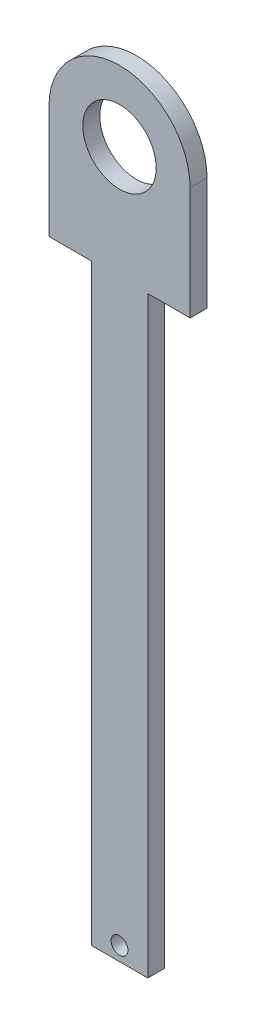
ISO-10303-21;
HEADER;
FILE_DESCRIPTION(('STEP AP214'),'2;1');
FILE_NAME('part.step','',(''),(''),'','','');
FILE_SCHEMA(('AUTOMOTIVE_DESIGN { 1 0 10303 214 1 1 1 1 }'));
ENDSEC;
DATA;
#1=APPLICATION_CONTEXT('core data for automotive mechanical design processes');
#2=APPLICATION_PROTOCOL_DEFINITION('international standard','automotive_design',2000,#1);
#3=PRODUCT_CONTEXT('',#1,'mechanical');
#4=PRODUCT('Part','Part','',(#3));
#5=PRODUCT_RELATED_PRODUCT_CATEGORY('part','',(#4));
#6=PRODUCT_DEFINITION_FORMATION('','',#4);
#7=PRODUCT_DEFINITION_CONTEXT('part definition',#1,'design');
#8=PRODUCT_DEFINITION('design','',#6,#7);
#9=PRODUCT_DEFINITION_SHAPE('','',#8);
#10=(LENGTH_UNIT() NAMED_UNIT(*) SI_UNIT(.MILLI.,.METRE.));
#11=(NAMED_UNIT(*) PLANE_ANGLE_UNIT() SI_UNIT($,.RADIAN.));
#12=(NAMED_UNIT(*) SI_UNIT($,.STERADIAN.) SOLID_ANGLE_UNIT());
#13=UNCERTAINTY_MEASURE_WITH_UNIT(LENGTH_MEASURE(1.E-05),#10,'distance_accuracy_value','');
#14=(GEOMETRIC_REPRESENTATION_CONTEXT(3) GLOBAL_UNCERTAINTY_ASSIGNED_CONTEXT((#13)) GLOBAL_UNIT_ASSIGNED_CONTEXT((#10,
#11,#12)) REPRESENTATION_CONTEXT('',''));
#15=CARTESIAN_POINT('',(0.,0.,0.));
#16=DIRECTION('',(0.,0.,1.));
#17=DIRECTION('',(1.,0.,0.));
#18=AXIS2_PLACEMENT_3D('',#15,#16,#17);
#19=CARTESIAN_POINT('',(0.,2.61849905544547,6.));
#20=DIRECTION('',(0.,1.,0.));
#21=DIRECTION('',(-1.,0.,0.));
#22=AXIS2_PLACEMENT_3D('',#19,#20,#21);
#23=PLANE('',#22);
#24=DIRECTION('',(0.,0.,-1.));
#25=VECTOR('',#24,1.);
#26=CARTESIAN_POINT('',(42.4580524034798,2.61849905544547,0.));
#27=LINE('',#26,#25);
#28=CARTESIAN_POINT('',(42.4580524034798,2.61849905544547,6.));
#29=VERTEX_POINT('',#28);
#30=CARTESIAN_POINT('',(42.4580524034798,2.61849905544547,0.));
#31=VERTEX_POINT('',#30);
#32=EDGE_CURVE('E51',#29,#31,#27,.T.);
#33=ORIENTED_EDGE('',*,*,#32,.F.);
#34=DIRECTION('',(1.,0.,0.));
#35=VECTOR('',#34,1.);
#36=CARTESIAN_POINT('',(0.,2.61849905544547,6.));
#37=LINE('',#36,#35);
#38=CARTESIAN_POINT('',(27.4580524034798,2.61849905544547,6.));
#39=VERTEX_POINT('',#38);
#40=EDGE_CURVE('E155',#39,#29,#37,.T.);
#41=ORIENTED_EDGE('',*,*,#40,.F.);
#42=DIRECTION('',(0.,0.,-1.));
#43=VECTOR('',#42,1.);
#44=CARTESIAN_POINT('',(27.4580524034798,2.61849905544547,6.));
#45=LINE('',#44,#43);
#46=CARTESIAN_POINT('',(27.4580524034798,2.61849905544547,0.));
#47=VERTEX_POINT('',#46);
#48=EDGE_CURVE('E172',#39,#47,#45,.T.);
#49=ORIENTED_EDGE('',*,*,#48,.T.);
#50=DIRECTION('',(1.,0.,0.));
#51=VECTOR('',#50,1.);
#52=CARTESIAN_POINT('',(0.,2.61849905544547,0.));
#53=LINE('',#52,#51);
#54=EDGE_CURVE('E145',#47,#31,#53,.T.);
#55=ORIENTED_EDGE('',*,*,#54,.T.);
#56=EDGE_LOOP('',(#33,#41,#49,#55));
#57=FACE_BOUND('',#56,.T.);
#58=ADVANCED_FACE('F36',(#57),#23,.F.);
#59=DIRECTION('',(0.,0.,1.));
#60=VECTOR('',#59,1.);
#61=CARTESIAN_POINT('',(62.4580524034798,2.61849905544547,0.));
#62=LINE('',#61,#60);
#63=CARTESIAN_POINT('',(62.4580524034798,2.61849905544548,0.));
#64=VERTEX_POINT('',#63);
#65=CARTESIAN_POINT('',(62.4580524034798,2.61849905544547,6.));
#66=VERTEX_POINT('',#65);
#67=EDGE_CURVE('E59',#64,#66,#62,.T.);
#68=ORIENTED_EDGE('',*,*,#67,.F.);
#69=CARTESIAN_POINT('',(77.4580524034798,2.61849905544548,0.));
#70=VERTEX_POINT('',#69);
#71=EDGE_CURVE('E168',#64,#70,#53,.T.);
#72=ORIENTED_EDGE('',*,*,#71,.T.);
#73=DIRECTION('',(0.,0.,-1.));
#74=VECTOR('',#73,1.);
#75=CARTESIAN_POINT('',(77.4580524034798,2.61849905544548,6.));
#76=LINE('',#75,#74);
#77=CARTESIAN_POINT('',(77.4580524034798,2.61849905544548,6.));
#78=VERTEX_POINT('',#77);
#79=EDGE_CURVE('E157',#78,#70,#76,.T.);
#80=ORIENTED_EDGE('',*,*,#79,.F.);
#81=EDGE_CURVE('E154',#66,#78,#37,.T.);
#82=ORIENTED_EDGE('',*,*,#81,.F.);
#83=EDGE_LOOP('',(#68,#72,#80,#82));
#84=FACE_BOUND('',#83,.T.);
#85=ADVANCED_FACE('F188',(#84),#23,.F.);
#86=CARTESIAN_POINT('',(77.4580524034798,0.,6.));
#87=DIRECTION('',(1.,0.,0.));
#88=DIRECTION('',(0.,0.,-1.));
#89=AXIS2_PLACEMENT_3D('',#86,#87,#88);
#90=PLANE('',#89);
#91=DIRECTION('',(0.,-1.,0.));
#92=VECTOR('',#91,1.);
#93=CARTESIAN_POINT('',(77.4580524034798,0.,0.));
#94=LINE('',#93,#92);
#95=CARTESIAN_POINT('',(77.4580524034798,42.6184990554455,0.));
#96=VERTEX_POINT('',#95);
#97=EDGE_CURVE('E160',#96,#70,#94,.T.);
#98=ORIENTED_EDGE('',*,*,#97,.F.);
#99=DIRECTION('',(0.,0.,-1.));
#100=VECTOR('',#99,1.);
#101=CARTESIAN_POINT('',(77.4580524034798,42.6184990554455,6.));
#102=LINE('',#101,#100);
#103=CARTESIAN_POINT('',(77.4580524034798,42.6184990554455,6.));
#104=VERTEX_POINT('',#103);
#105=EDGE_CURVE('E11',#104,#96,#102,.T.);
#106=ORIENTED_EDGE('',*,*,#105,.F.);
#107=DIRECTION('',(0.,-1.,0.));
#108=VECTOR('',#107,1.);
#109=CARTESIAN_POINT('',(77.4580524034798,0.,6.));
#110=LINE('',#109,#108);
#111=EDGE_CURVE('E144',#104,#78,#110,.T.);
#112=ORIENTED_EDGE('',*,*,#111,.T.);
#113=ORIENTED_EDGE('',*,*,#79,.T.);
#114=EDGE_LOOP('',(#98,#106,#112,#113));
#115=FACE_BOUND('',#114,.T.);
#116=ADVANCED_FACE('F185',(#115),#90,.T.);
#117=CARTESIAN_POINT('',(52.4580524034798,42.6184990554455,6.));
#118=DIRECTION('',(0.,0.,-1.));
#119=DIRECTION('',(-1.,0.,0.));
#120=AXIS2_PLACEMENT_3D('',#117,#118,#119);
#121=CYLINDRICAL_SURFACE('',#120,25.);
#122=CARTESIAN_POINT('',(52.4580524034798,42.6184990554455,0.));
#123=DIRECTION('',(0.,0.,1.));
#124=DIRECTION('',(1.,0.,0.));
#125=AXIS2_PLACEMENT_3D('',#122,#123,#124);
#126=CIRCLE('',#125,25.);
#127=CARTESIAN_POINT('',(27.4580524034798,42.6184990554455,0.));
#128=VERTEX_POINT('',#127);
#129=EDGE_CURVE('E162',#96,#128,#126,.T.);
#130=ORIENTED_EDGE('',*,*,#129,.T.);
#131=DIRECTION('',(0.,0.,-1.));
#132=VECTOR('',#131,1.);
#133=CARTESIAN_POINT('',(27.4580524034798,42.6184990554455,6.));
#134=LINE('',#133,#132);
#135=CARTESIAN_POINT('',(27.4580524034798,42.6184990554455,6.));
#136=VERTEX_POINT('',#135);
#137=EDGE_CURVE('E44',#136,#128,#134,.T.);
#138=ORIENTED_EDGE('',*,*,#137,.F.);
#139=CARTESIAN_POINT('',(52.4580524034798,42.6184990554455,6.));
#140=DIRECTION('',(0.,0.,1.));
#141=DIRECTION('',(1.,0.,0.));
#142=AXIS2_PLACEMENT_3D('',#139,#140,#141);
#143=CIRCLE('',#142,25.);
#144=EDGE_CURVE('E148',#104,#136,#143,.T.);
#145=ORIENTED_EDGE('',*,*,#144,.F.);
#146=ORIENTED_EDGE('',*,*,#105,.T.);
#147=EDGE_LOOP('',(#130,#138,#145,#146));
#148=FACE_BOUND('',#147,.T.);
#149=ADVANCED_FACE('F182',(#148),#121,.T.);
#150=CARTESIAN_POINT('',(27.4580524034798,0.,6.));
#151=DIRECTION('',(1.,0.,0.));
#152=DIRECTION('',(0.,1.,0.));
#153=AXIS2_PLACEMENT_3D('',#150,#151,#152);
#154=PLANE('',#153);
#155=DIRECTION('',(0.,-1.,0.));
#156=VECTOR('',#155,1.);
#157=CARTESIAN_POINT('',(27.4580524034798,0.,0.));
#158=LINE('',#157,#156);
#159=EDGE_CURVE('E165',#128,#47,#158,.T.);
#160=ORIENTED_EDGE('',*,*,#159,.T.);
#161=ORIENTED_EDGE('',*,*,#48,.F.);
#162=DIRECTION('',(0.,-1.,0.));
#163=VECTOR('',#162,1.);
#164=CARTESIAN_POINT('',(27.4580524034798,0.,6.));
#165=LINE('',#164,#163);
#166=EDGE_CURVE('E151',#136,#39,#165,.T.);
#167=ORIENTED_EDGE('',*,*,#166,.F.);
#168=ORIENTED_EDGE('',*,*,#137,.T.);
#169=EDGE_LOOP('',(#160,#161,#167,#168));
#170=FACE_BOUND('',#169,.T.);
#171=ADVANCED_FACE('F177',(#170),#154,.F.);
#172=CARTESIAN_POINT('',(52.4580524034798,42.6184990554455,6.));
#173=DIRECTION('',(0.,0.,-1.));
#174=DIRECTION('',(-1.,0.,0.));
#175=AXIS2_PLACEMENT_3D('',#172,#173,#174);
#176=CYLINDRICAL_SURFACE('',#175,13.);
#177=CARTESIAN_POINT('',(52.4580524034798,42.6184990554455,6.));
#178=DIRECTION('',(0.,0.,1.));
#179=DIRECTION('',(1.,0.,0.));
#180=AXIS2_PLACEMENT_3D('',#177,#178,#179);
#181=CIRCLE('',#180,13.);
#182=CARTESIAN_POINT('',(65.4580524034798,42.6184990554455,6.));
#183=VERTEX_POINT('',#182);
#184=EDGE_CURVE('E141',#183,#183,#181,.T.);
#185=ORIENTED_EDGE('',*,*,#184,.T.);
#186=EDGE_LOOP('',(#185));
#187=FACE_BOUND('',#186,.T.);
#188=CARTESIAN_POINT('',(52.4580524034798,42.6184990554455,0.));
#189=DIRECTION('',(0.,0.,1.));
#190=DIRECTION('',(1.,0.,0.));
#191=AXIS2_PLACEMENT_3D('',#188,#189,#190);
#192=CIRCLE('',#191,13.);
#193=CARTESIAN_POINT('',(65.4580524034798,42.6184990554455,0.));
#194=VERTEX_POINT('',#193);
#195=EDGE_CURVE('E108',#194,#194,#192,.T.);
#196=ORIENTED_EDGE('',*,*,#195,.F.);
#197=EDGE_LOOP('',(#196));
#198=FACE_BOUND('',#197,.T.);
#199=ADVANCED_FACE('F38',(#187,#198),#176,.F.);
#200=CARTESIAN_POINT('',(0.,0.,6.));
#201=DIRECTION('',(0.,0.,1.));
#202=DIRECTION('',(1.,0.,0.));
#203=AXIS2_PLACEMENT_3D('',#200,#201,#202);
#204=PLANE('',#203);
#205=ORIENTED_EDGE('',*,*,#184,.F.);
#206=EDGE_LOOP('',(#205));
#207=FACE_BOUND('',#206,.T.);
#208=ORIENTED_EDGE('',*,*,#111,.F.);
#209=ORIENTED_EDGE('',*,*,#144,.T.);
#210=ORIENTED_EDGE('',*,*,#166,.T.);
#211=ORIENTED_EDGE('',*,*,#40,.T.);
#212=DIRECTION('',(0.,1.,0.));
#213=VECTOR('',#212,1.);
#214=CARTESIAN_POINT('',(42.4580524034798,-197.381500944555,6.));
#215=LINE('',#214,#213);
#216=CARTESIAN_POINT('',(42.4580524034798,-207.381500944555,6.));
#217=VERTEX_POINT('',#216);
#218=EDGE_CURVE('E135',#217,#29,#215,.T.);
#219=ORIENTED_EDGE('',*,*,#218,.F.);
#220=DIRECTION('',(1.,0.,0.));
#221=VECTOR('',#220,1.);
#222=CARTESIAN_POINT('',(42.4580524034798,-207.381500944555,6.));
#223=LINE('',#222,#221);
#224=CARTESIAN_POINT('',(62.4580524034798,-207.381500944555,6.));
#225=VERTEX_POINT('',#224);
#226=EDGE_CURVE('E117',#217,#225,#223,.T.);
#227=ORIENTED_EDGE('',*,*,#226,.T.);
#228=DIRECTION('',(0.,1.,0.));
#229=VECTOR('',#228,1.);
#230=CARTESIAN_POINT('',(62.4580524034798,-197.381500944555,6.));
#231=LINE('',#230,#229);
#232=EDGE_CURVE('E137',#225,#66,#231,.T.);
#233=ORIENTED_EDGE('',*,*,#232,.T.);
#234=ORIENTED_EDGE('',*,*,#81,.T.);
#235=EDGE_LOOP('',(#208,#209,#210,#211,#219,#227,#233,#234));
#236=FACE_BOUND('',#235,.T.);
#237=CARTESIAN_POINT('',(52.4580524034798,-202.381500944555,6.));
#238=DIRECTION('',(0.,0.,1.));
#239=DIRECTION('',(1.,0.,0.));
#240=AXIS2_PLACEMENT_3D('',#237,#238,#239);
#241=CIRCLE('',#240,3.);
#242=CARTESIAN_POINT('',(55.4580524034798,-202.381500944555,6.));
#243=VERTEX_POINT('',#242);
#244=EDGE_CURVE('E129',#243,#243,#241,.T.);
#245=ORIENTED_EDGE('',*,*,#244,.F.);
#246=EDGE_LOOP('',(#245));
#247=FACE_BOUND('',#246,.T.);
#248=ADVANCED_FACE('F192',(#207,#236,#247),#204,.T.);
#249=CARTESIAN_POINT('',(0.,0.,0.));
#250=DIRECTION('',(0.,0.,1.));
#251=DIRECTION('',(1.,0.,0.));
#252=AXIS2_PLACEMENT_3D('',#249,#250,#251);
#253=PLANE('',#252);
#254=ORIENTED_EDGE('',*,*,#195,.T.);
#255=EDGE_LOOP('',(#254));
#256=FACE_BOUND('',#255,.T.);
#257=ORIENTED_EDGE('',*,*,#97,.T.);
#258=ORIENTED_EDGE('',*,*,#71,.F.);
#259=DIRECTION('',(0.,1.,0.));
#260=VECTOR('',#259,1.);
#261=CARTESIAN_POINT('',(62.4580524034798,-197.381500944555,0.));
#262=LINE('',#261,#260);
#263=CARTESIAN_POINT('',(62.4580524034798,-207.381500944555,0.));
#264=VERTEX_POINT('',#263);
#265=EDGE_CURVE('E109',#264,#64,#262,.T.);
#266=ORIENTED_EDGE('',*,*,#265,.F.);
#267=DIRECTION('',(1.,0.,0.));
#268=VECTOR('',#267,1.);
#269=CARTESIAN_POINT('',(42.4580524034798,-207.381500944555,0.));
#270=LINE('',#269,#268);
#271=CARTESIAN_POINT('',(42.4580524034798,-207.381500944555,0.));
#272=VERTEX_POINT('',#271);
#273=EDGE_CURVE('E115',#272,#264,#270,.T.);
#274=ORIENTED_EDGE('',*,*,#273,.F.);
#275=DIRECTION('',(0.,1.,0.));
#276=VECTOR('',#275,1.);
#277=CARTESIAN_POINT('',(42.4580524034798,-197.381500944555,0.));
#278=LINE('',#277,#276);
#279=EDGE_CURVE('E100',#272,#31,#278,.T.);
#280=ORIENTED_EDGE('',*,*,#279,.T.);
#281=ORIENTED_EDGE('',*,*,#54,.F.);
#282=ORIENTED_EDGE('',*,*,#159,.F.);
#283=ORIENTED_EDGE('',*,*,#129,.F.);
#284=EDGE_LOOP('',(#257,#258,#266,#274,#280,#281,#282,#283));
#285=FACE_BOUND('',#284,.T.);
#286=CARTESIAN_POINT('',(52.4580524034798,-202.381500944555,0.));
#287=DIRECTION('',(0.,0.,1.));
#288=DIRECTION('',(1.,0.,0.));
#289=AXIS2_PLACEMENT_3D('',#286,#287,#288);
#290=CIRCLE('',#289,3.);
#291=CARTESIAN_POINT('',(55.4580524034798,-202.381500944555,0.));
#292=VERTEX_POINT('',#291);
#293=EDGE_CURVE('E126',#292,#292,#290,.T.);
#294=ORIENTED_EDGE('',*,*,#293,.T.);
#295=EDGE_LOOP('',(#294));
#296=FACE_BOUND('',#295,.T.);
#297=ADVANCED_FACE('F121',(#256,#285,#296),#253,.F.);
#298=CARTESIAN_POINT('',(42.4580524034798,-197.381500944555,0.));
#299=DIRECTION('',(1.,0.,0.));
#300=DIRECTION('',(0.,0.,-1.));
#301=AXIS2_PLACEMENT_3D('',#298,#299,#300);
#302=PLANE('',#301);
#303=ORIENTED_EDGE('',*,*,#32,.T.);
#304=ORIENTED_EDGE('',*,*,#279,.F.);
#305=DIRECTION('',(0.,0.,1.));
#306=VECTOR('',#305,1.);
#307=CARTESIAN_POINT('',(42.4580524034798,-207.381500944555,0.));
#308=LINE('',#307,#306);
#309=EDGE_CURVE('E104',#272,#217,#308,.T.);
#310=ORIENTED_EDGE('',*,*,#309,.T.);
#311=ORIENTED_EDGE('',*,*,#218,.T.);
#312=EDGE_LOOP('',(#303,#304,#310,#311));
#313=FACE_BOUND('',#312,.T.);
#314=ADVANCED_FACE('F102',(#313),#302,.F.);
#315=CARTESIAN_POINT('',(62.4580524034798,-197.381500944555,0.));
#316=DIRECTION('',(-1.,0.,0.));
#317=DIRECTION('',(0.,0.,1.));
#318=AXIS2_PLACEMENT_3D('',#315,#316,#317);
#319=PLANE('',#318);
#320=ORIENTED_EDGE('',*,*,#67,.T.);
#321=ORIENTED_EDGE('',*,*,#232,.F.);
#322=DIRECTION('',(0.,0.,1.));
#323=VECTOR('',#322,1.);
#324=CARTESIAN_POINT('',(62.4580524034798,-207.381500944555,0.));
#325=LINE('',#324,#323);
#326=EDGE_CURVE('E118',#264,#225,#325,.T.);
#327=ORIENTED_EDGE('',*,*,#326,.F.);
#328=ORIENTED_EDGE('',*,*,#265,.T.);
#329=EDGE_LOOP('',(#320,#321,#327,#328));
#330=FACE_BOUND('',#329,.T.);
#331=ADVANCED_FACE('F190',(#330),#319,.F.);
#332=CARTESIAN_POINT('',(42.4580524034798,-207.381500944555,0.));
#333=DIRECTION('',(0.,-1.,0.));
#334=DIRECTION('',(0.,0.,-1.));
#335=AXIS2_PLACEMENT_3D('',#332,#333,#334);
#336=PLANE('',#335);
#337=ORIENTED_EDGE('',*,*,#226,.F.);
#338=ORIENTED_EDGE('',*,*,#309,.F.);
#339=ORIENTED_EDGE('',*,*,#273,.T.);
#340=ORIENTED_EDGE('',*,*,#326,.T.);
#341=EDGE_LOOP('',(#337,#338,#339,#340));
#342=FACE_BOUND('',#341,.T.);
#343=ADVANCED_FACE('F113',(#342),#336,.T.);
#344=CARTESIAN_POINT('',(52.4580524034798,-202.381500944555,0.));
#345=DIRECTION('',(0.,0.,1.));
#346=DIRECTION('',(1.,0.,0.));
#347=AXIS2_PLACEMENT_3D('',#344,#345,#346);
#348=CYLINDRICAL_SURFACE('',#347,3.);
#349=ORIENTED_EDGE('',*,*,#293,.F.);
#350=EDGE_LOOP('',(#349));
#351=FACE_BOUND('',#350,.T.);
#352=ORIENTED_EDGE('',*,*,#244,.T.);
#353=EDGE_LOOP('',(#352));
#354=FACE_BOUND('',#353,.T.);
#355=ADVANCED_FACE('F255',(#351,#354),#348,.F.);
#356=CLOSED_SHELL('',(#58,#85,#116,#149,#171,#199,#248,#297,#314,#331,#343,#355));
#357=MANIFOLD_SOLID_BREP('B2',#356);
#358=ADVANCED_BREP_SHAPE_REPRESENTATION('',(#18,#357),#14);
#359=SHAPE_DEFINITION_REPRESENTATION(#9,#358);
ENDSEC;
END-ISO-10303-21;
